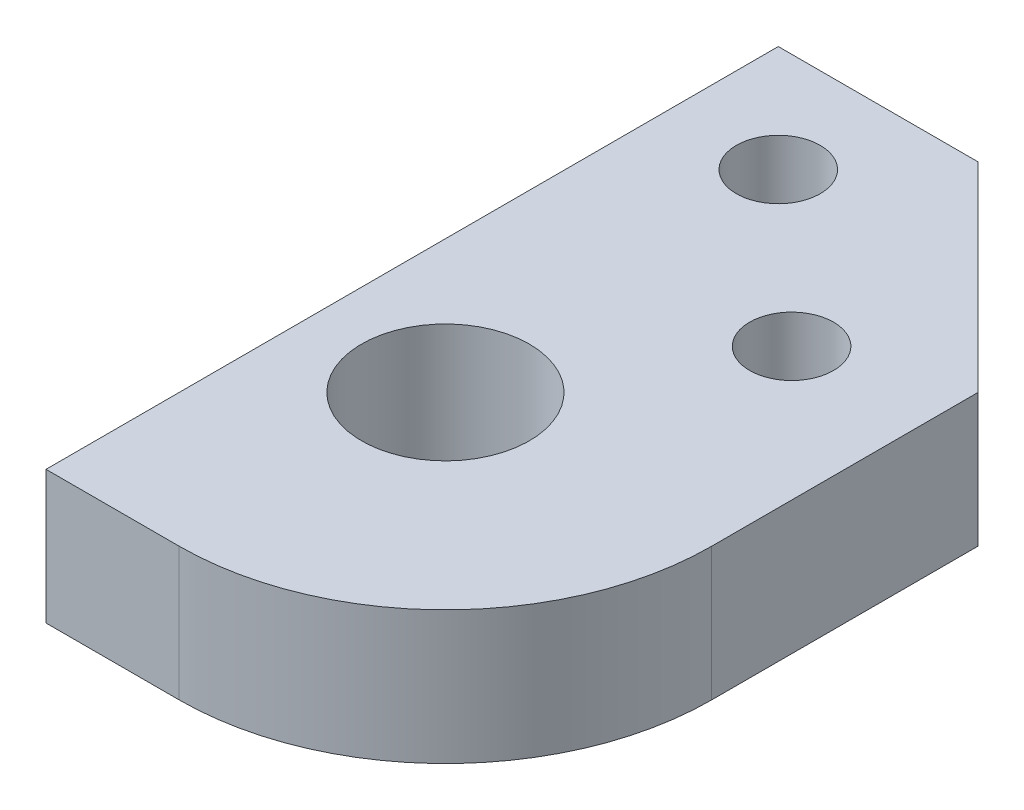
ISO-10303-21;
HEADER;
FILE_DESCRIPTION(('STEP AP214'),'2;1');
FILE_NAME('part.step','',(''),(''),'','','');
FILE_SCHEMA(('AUTOMOTIVE_DESIGN { 1 0 10303 214 1 1 1 1 }'));
ENDSEC;
DATA;
#1=APPLICATION_CONTEXT('core data for automotive mechanical design processes');
#2=APPLICATION_PROTOCOL_DEFINITION('international standard','automotive_design',2000,#1);
#3=PRODUCT_CONTEXT('',#1,'mechanical');
#4=PRODUCT('Part','Part','',(#3));
#5=PRODUCT_RELATED_PRODUCT_CATEGORY('part','',(#4));
#6=PRODUCT_DEFINITION_FORMATION('','',#4);
#7=PRODUCT_DEFINITION_CONTEXT('part definition',#1,'design');
#8=PRODUCT_DEFINITION('design','',#6,#7);
#9=PRODUCT_DEFINITION_SHAPE('','',#8);
#10=(LENGTH_UNIT() NAMED_UNIT(*) SI_UNIT(.MILLI.,.METRE.));
#11=(NAMED_UNIT(*) PLANE_ANGLE_UNIT() SI_UNIT($,.RADIAN.));
#12=(NAMED_UNIT(*) SI_UNIT($,.STERADIAN.) SOLID_ANGLE_UNIT());
#13=UNCERTAINTY_MEASURE_WITH_UNIT(LENGTH_MEASURE(1.E-05),#10,'distance_accuracy_value','');
#14=(GEOMETRIC_REPRESENTATION_CONTEXT(3) GLOBAL_UNCERTAINTY_ASSIGNED_CONTEXT((#13)) GLOBAL_UNIT_ASSIGNED_CONTEXT((#10,
#11,#12)) REPRESENTATION_CONTEXT('',''));
#15=CARTESIAN_POINT('',(0.,0.,0.));
#16=DIRECTION('',(0.,0.,1.));
#17=DIRECTION('',(1.,0.,0.));
#18=AXIS2_PLACEMENT_3D('',#15,#16,#17);
#19=CARTESIAN_POINT('',(12.7,6.35,114.3));
#20=DIRECTION('',(0.,-1.,0.));
#21=DIRECTION('',(0.,0.,1.));
#22=AXIS2_PLACEMENT_3D('',#19,#20,#21);
#23=CYLINDRICAL_SURFACE('',#22,12.7);
#24=CARTESIAN_POINT('',(12.7,0.,114.3));
#25=DIRECTION('',(0.,-1.,0.));
#26=DIRECTION('',(0.,0.,-1.));
#27=AXIS2_PLACEMENT_3D('',#24,#25,#26);
#28=CIRCLE('',#27,12.7);
#29=CARTESIAN_POINT('',(12.6999999999999,0.,127.));
#30=VERTEX_POINT('',#29);
#31=CARTESIAN_POINT('',(25.4,0.,114.3));
#32=VERTEX_POINT('',#31);
#33=EDGE_CURVE('E133',#30,#32,#28,.F.);
#34=ORIENTED_EDGE('',*,*,#33,.T.);
#35=DIRECTION('',(0.,-1.,0.));
#36=VECTOR('',#35,1.);
#37=CARTESIAN_POINT('',(25.4,6.35,114.3));
#38=LINE('',#37,#36);
#39=CARTESIAN_POINT('',(25.4,6.35,114.3));
#40=VERTEX_POINT('',#39);
#41=EDGE_CURVE('E129',#40,#32,#38,.T.);
#42=ORIENTED_EDGE('',*,*,#41,.F.);
#43=CARTESIAN_POINT('',(12.7,6.35,114.3));
#44=DIRECTION('',(0.,-1.,0.));
#45=DIRECTION('',(0.,0.,-1.));
#46=AXIS2_PLACEMENT_3D('',#43,#44,#45);
#47=CIRCLE('',#46,12.7);
#48=CARTESIAN_POINT('',(12.6999999999999,6.35,127.));
#49=VERTEX_POINT('',#48);
#50=EDGE_CURVE('E165',#49,#40,#47,.F.);
#51=ORIENTED_EDGE('',*,*,#50,.F.);
#52=DIRECTION('',(0.,-1.,0.));
#53=VECTOR('',#52,1.);
#54=CARTESIAN_POINT('',(12.6999999999999,6.35,127.));
#55=LINE('',#54,#53);
#56=EDGE_CURVE('E11',#49,#30,#55,.T.);
#57=ORIENTED_EDGE('',*,*,#56,.T.);
#58=EDGE_LOOP('',(#34,#42,#51,#57));
#59=FACE_BOUND('',#58,.T.);
#60=ADVANCED_FACE('F39',(#59),#23,.T.);
#61=CARTESIAN_POINT('',(0.,6.35,127.));
#62=DIRECTION('',(0.,0.,1.));
#63=DIRECTION('',(-1.,0.,0.));
#64=AXIS2_PLACEMENT_3D('',#61,#62,#63);
#65=PLANE('',#64);
#66=DIRECTION('',(1.,0.,0.));
#67=VECTOR('',#66,1.);
#68=CARTESIAN_POINT('',(0.,0.,127.));
#69=LINE('',#68,#67);
#70=CARTESIAN_POINT('',(6.3499999999998,0.,127.));
#71=VERTEX_POINT('',#70);
#72=EDGE_CURVE('E136',#71,#30,#69,.T.);
#73=ORIENTED_EDGE('',*,*,#72,.T.);
#74=ORIENTED_EDGE('',*,*,#56,.F.);
#75=DIRECTION('',(1.,0.,0.));
#76=VECTOR('',#75,1.);
#77=CARTESIAN_POINT('',(0.,6.35,127.));
#78=LINE('',#77,#76);
#79=CARTESIAN_POINT('',(6.3499999999998,6.35,127.));
#80=VERTEX_POINT('',#79);
#81=EDGE_CURVE('E88',#80,#49,#78,.T.);
#82=ORIENTED_EDGE('',*,*,#81,.F.);
#83=DIRECTION('',(0.,-1.,0.));
#84=VECTOR('',#83,1.);
#85=CARTESIAN_POINT('',(6.3499999999998,6.35,127.));
#86=LINE('',#85,#84);
#87=EDGE_CURVE('E48',#80,#71,#86,.T.);
#88=ORIENTED_EDGE('',*,*,#87,.T.);
#89=EDGE_LOOP('',(#73,#74,#82,#88));
#90=FACE_BOUND('',#89,.T.);
#91=ADVANCED_FACE('F158',(#90),#65,.T.);
#92=CARTESIAN_POINT('',(6.3500000000005,6.35,0.));
#93=DIRECTION('',(1.,0.,0.));
#94=DIRECTION('',(0.,0.,1.));
#95=AXIS2_PLACEMENT_3D('',#92,#93,#94);
#96=PLANE('',#95);
#97=DIRECTION('',(0.,0.,-1.));
#98=VECTOR('',#97,1.);
#99=CARTESIAN_POINT('',(6.3500000000005,0.,0.));
#100=LINE('',#99,#98);
#101=CARTESIAN_POINT('',(6.34999999999996,0.,92.0749999999997));
#102=VERTEX_POINT('',#101);
#103=EDGE_CURVE('E138',#71,#102,#100,.T.);
#104=ORIENTED_EDGE('',*,*,#103,.F.);
#105=ORIENTED_EDGE('',*,*,#87,.F.);
#106=DIRECTION('',(0.,0.,-1.));
#107=VECTOR('',#106,1.);
#108=CARTESIAN_POINT('',(6.3500000000005,6.35,0.));
#109=LINE('',#108,#107);
#110=CARTESIAN_POINT('',(6.34999999999996,6.35,92.0749999999997));
#111=VERTEX_POINT('',#110);
#112=EDGE_CURVE('E117',#80,#111,#109,.T.);
#113=ORIENTED_EDGE('',*,*,#112,.T.);
#114=DIRECTION('',(0.,-1.,0.));
#115=VECTOR('',#114,1.);
#116=CARTESIAN_POINT('',(6.34999999999996,6.35,92.0749999999997));
#117=LINE('',#116,#115);
#118=EDGE_CURVE('E111',#111,#102,#117,.T.);
#119=ORIENTED_EDGE('',*,*,#118,.T.);
#120=EDGE_LOOP('',(#104,#105,#113,#119));
#121=FACE_BOUND('',#120,.T.);
#122=ADVANCED_FACE('F189',(#121),#96,.F.);
#123=CARTESIAN_POINT('',(-1.34151948808872E-13,6.35,92.0749999999997));
#124=DIRECTION('',(0.,0.,1.));
#125=DIRECTION('',(-1.,0.,0.));
#126=AXIS2_PLACEMENT_3D('',#123,#124,#125);
#127=PLANE('',#126);
#128=DIRECTION('',(1.,0.,0.));
#129=VECTOR('',#128,1.);
#130=CARTESIAN_POINT('',(-1.34151948808872E-13,0.,92.0749999999997));
#131=LINE('',#130,#129);
#132=CARTESIAN_POINT('',(15.875,0.,92.0749999999998));
#133=VERTEX_POINT('',#132);
#134=EDGE_CURVE('E141',#102,#133,#131,.T.);
#135=ORIENTED_EDGE('',*,*,#134,.F.);
#136=ORIENTED_EDGE('',*,*,#118,.F.);
#137=DIRECTION('',(1.,0.,0.));
#138=VECTOR('',#137,1.);
#139=CARTESIAN_POINT('',(-1.34151948808872E-13,6.35,92.0749999999997));
#140=LINE('',#139,#138);
#141=CARTESIAN_POINT('',(15.875,6.35,92.0749999999998));
#142=VERTEX_POINT('',#141);
#143=EDGE_CURVE('E101',#111,#142,#140,.T.);
#144=ORIENTED_EDGE('',*,*,#143,.T.);
#145=DIRECTION('',(0.,-1.,0.));
#146=VECTOR('',#145,1.);
#147=CARTESIAN_POINT('',(15.875,6.35,92.0749999999998));
#148=LINE('',#147,#146);
#149=EDGE_CURVE('E106',#142,#133,#148,.T.);
#150=ORIENTED_EDGE('',*,*,#149,.T.);
#151=EDGE_LOOP('',(#135,#136,#144,#150));
#152=FACE_BOUND('',#151,.T.);
#153=ADVANCED_FACE('F114',(#152),#127,.F.);
#154=CARTESIAN_POINT('',(-38.0999999999997,6.35,38.0999999999987));
#155=DIRECTION('',(0.707106781186556,0.,-0.707106781186539));
#156=DIRECTION('',(0.707106781186539,0.,0.707106781186556));
#157=AXIS2_PLACEMENT_3D('',#154,#155,#156);
#158=PLANE('',#157);
#159=DIRECTION('',(-0.707106781186539,0.,-0.707106781186556));
#160=VECTOR('',#159,1.);
#161=CARTESIAN_POINT('',(-38.0999999999997,0.,38.0999999999987));
#162=LINE('',#161,#160);
#163=CARTESIAN_POINT('',(25.4,0.,101.6));
#164=VERTEX_POINT('',#163);
#165=EDGE_CURVE('E108',#164,#133,#162,.T.);
#166=ORIENTED_EDGE('',*,*,#165,.T.);
#167=ORIENTED_EDGE('',*,*,#149,.F.);
#168=DIRECTION('',(-0.707106781186539,0.,-0.707106781186556));
#169=VECTOR('',#168,1.);
#170=CARTESIAN_POINT('',(-38.0999999999997,6.35,38.0999999999987));
#171=LINE('',#170,#169);
#172=CARTESIAN_POINT('',(25.4,6.35,101.6));
#173=VERTEX_POINT('',#172);
#174=EDGE_CURVE('E96',#173,#142,#171,.T.);
#175=ORIENTED_EDGE('',*,*,#174,.F.);
#176=DIRECTION('',(0.,-1.,0.));
#177=VECTOR('',#176,1.);
#178=CARTESIAN_POINT('',(25.4,6.35,101.6));
#179=LINE('',#178,#177);
#180=EDGE_CURVE('E112',#173,#164,#179,.T.);
#181=ORIENTED_EDGE('',*,*,#180,.T.);
#182=EDGE_LOOP('',(#166,#167,#175,#181));
#183=FACE_BOUND('',#182,.T.);
#184=ADVANCED_FACE('F107',(#183),#158,.T.);
#185=CARTESIAN_POINT('',(19.0499999999999,6.35,104.14));
#186=DIRECTION('',(0.,-1.,0.));
#187=DIRECTION('',(0.,0.,1.));
#188=AXIS2_PLACEMENT_3D('',#185,#186,#187);
#189=CYLINDRICAL_SURFACE('',#188,2.);
#190=CARTESIAN_POINT('',(19.0499999999999,6.35,104.14));
#191=DIRECTION('',(0.,-1.,0.));
#192=DIRECTION('',(0.,0.,-1.));
#193=AXIS2_PLACEMENT_3D('',#190,#191,#192);
#194=CIRCLE('',#193,2.);
#195=CARTESIAN_POINT('',(19.0499999999999,6.35,102.14));
#196=VERTEX_POINT('',#195);
#197=EDGE_CURVE('E123',#196,#196,#194,.T.);
#198=ORIENTED_EDGE('',*,*,#197,.F.);
#199=EDGE_LOOP('',(#198));
#200=FACE_BOUND('',#199,.T.);
#201=CARTESIAN_POINT('',(19.0499999999999,0.,104.14));
#202=DIRECTION('',(0.,-1.,0.));
#203=DIRECTION('',(0.,0.,-1.));
#204=AXIS2_PLACEMENT_3D('',#201,#202,#203);
#205=CIRCLE('',#204,2.);
#206=CARTESIAN_POINT('',(19.0499999999999,0.,102.14));
#207=VERTEX_POINT('',#206);
#208=EDGE_CURVE('E145',#207,#207,#205,.T.);
#209=ORIENTED_EDGE('',*,*,#208,.T.);
#210=EDGE_LOOP('',(#209));
#211=FACE_BOUND('',#210,.T.);
#212=ADVANCED_FACE('F198',(#200,#211),#189,.F.);
#213=CARTESIAN_POINT('',(25.4,6.35,0.));
#214=DIRECTION('',(-1.,0.,0.));
#215=DIRECTION('',(0.,0.,-1.));
#216=AXIS2_PLACEMENT_3D('',#213,#214,#215);
#217=PLANE('',#216);
#218=DIRECTION('',(0.,0.,1.));
#219=VECTOR('',#218,1.);
#220=CARTESIAN_POINT('',(25.4,0.,0.));
#221=LINE('',#220,#219);
#222=EDGE_CURVE('E76',#164,#32,#221,.T.);
#223=ORIENTED_EDGE('',*,*,#222,.F.);
#224=ORIENTED_EDGE('',*,*,#180,.F.);
#225=DIRECTION('',(0.,0.,1.));
#226=VECTOR('',#225,1.);
#227=CARTESIAN_POINT('',(25.4,6.35,0.));
#228=LINE('',#227,#226);
#229=EDGE_CURVE('E56',#173,#40,#228,.T.);
#230=ORIENTED_EDGE('',*,*,#229,.T.);
#231=ORIENTED_EDGE('',*,*,#41,.T.);
#232=EDGE_LOOP('',(#223,#224,#230,#231));
#233=FACE_BOUND('',#232,.T.);
#234=ADVANCED_FACE('F175',(#233),#217,.F.);
#235=CARTESIAN_POINT('',(12.7,6.35,114.3));
#236=DIRECTION('',(0.,-1.,0.));
#237=DIRECTION('',(0.,0.,1.));
#238=AXIS2_PLACEMENT_3D('',#235,#236,#237);
#239=CYLINDRICAL_SURFACE('',#238,4.0005);
#240=CARTESIAN_POINT('',(12.7,6.35,114.3));
#241=DIRECTION('',(0.,-1.,0.));
#242=DIRECTION('',(0.,0.,-1.));
#243=AXIS2_PLACEMENT_3D('',#240,#241,#242);
#244=CIRCLE('',#243,4.0005);
#245=CARTESIAN_POINT('',(12.7,6.35,110.2995));
#246=VERTEX_POINT('',#245);
#247=EDGE_CURVE('E151',#246,#246,#244,.T.);
#248=ORIENTED_EDGE('',*,*,#247,.F.);
#249=EDGE_LOOP('',(#248));
#250=FACE_BOUND('',#249,.T.);
#251=CARTESIAN_POINT('',(12.7,0.,114.3));
#252=DIRECTION('',(0.,-1.,0.));
#253=DIRECTION('',(0.,0.,-1.));
#254=AXIS2_PLACEMENT_3D('',#251,#252,#253);
#255=CIRCLE('',#254,4.0005);
#256=CARTESIAN_POINT('',(12.7,0.,110.2995));
#257=VERTEX_POINT('',#256);
#258=EDGE_CURVE('E130',#257,#257,#255,.T.);
#259=ORIENTED_EDGE('',*,*,#258,.T.);
#260=EDGE_LOOP('',(#259));
#261=FACE_BOUND('',#260,.T.);
#262=ADVANCED_FACE('F41',(#250,#261),#239,.F.);
#263=CARTESIAN_POINT('',(11.4299999999998,6.35,97.1549999999999));
#264=DIRECTION('',(0.,-1.,0.));
#265=DIRECTION('',(0.,0.,1.));
#266=AXIS2_PLACEMENT_3D('',#263,#264,#265);
#267=CYLINDRICAL_SURFACE('',#266,2.);
#268=CARTESIAN_POINT('',(11.4299999999998,6.35,97.1549999999999));
#269=DIRECTION('',(0.,-1.,0.));
#270=DIRECTION('',(0.,0.,-1.));
#271=AXIS2_PLACEMENT_3D('',#268,#269,#270);
#272=CIRCLE('',#271,2.);
#273=CARTESIAN_POINT('',(11.4299999999998,6.35,95.1549999999999));
#274=VERTEX_POINT('',#273);
#275=EDGE_CURVE('E126',#274,#274,#272,.T.);
#276=ORIENTED_EDGE('',*,*,#275,.F.);
#277=EDGE_LOOP('',(#276));
#278=FACE_BOUND('',#277,.T.);
#279=CARTESIAN_POINT('',(11.4299999999998,0.,97.1549999999999));
#280=DIRECTION('',(0.,-1.,0.));
#281=DIRECTION('',(0.,0.,-1.));
#282=AXIS2_PLACEMENT_3D('',#279,#280,#281);
#283=CIRCLE('',#282,2.);
#284=CARTESIAN_POINT('',(11.4299999999998,0.,95.1549999999999));
#285=VERTEX_POINT('',#284);
#286=EDGE_CURVE('E148',#285,#285,#283,.T.);
#287=ORIENTED_EDGE('',*,*,#286,.T.);
#288=EDGE_LOOP('',(#287));
#289=FACE_BOUND('',#288,.T.);
#290=ADVANCED_FACE('F174',(#278,#289),#267,.F.);
#291=CARTESIAN_POINT('',(0.,6.35,0.));
#292=DIRECTION('',(0.,1.,0.));
#293=DIRECTION('',(0.,0.,-1.));
#294=AXIS2_PLACEMENT_3D('',#291,#292,#293);
#295=PLANE('',#294);
#296=ORIENTED_EDGE('',*,*,#247,.T.);
#297=EDGE_LOOP('',(#296));
#298=FACE_BOUND('',#297,.T.);
#299=ORIENTED_EDGE('',*,*,#50,.T.);
#300=ORIENTED_EDGE('',*,*,#229,.F.);
#301=ORIENTED_EDGE('',*,*,#174,.T.);
#302=ORIENTED_EDGE('',*,*,#143,.F.);
#303=ORIENTED_EDGE('',*,*,#112,.F.);
#304=ORIENTED_EDGE('',*,*,#81,.T.);
#305=EDGE_LOOP('',(#299,#300,#301,#302,#303,#304));
#306=FACE_BOUND('',#305,.T.);
#307=ORIENTED_EDGE('',*,*,#197,.T.);
#308=EDGE_LOOP('',(#307));
#309=FACE_BOUND('',#308,.T.);
#310=ORIENTED_EDGE('',*,*,#275,.T.);
#311=EDGE_LOOP('',(#310));
#312=FACE_BOUND('',#311,.T.);
#313=ADVANCED_FACE('F98',(#298,#306,#309,#312),#295,.T.);
#314=CARTESIAN_POINT('',(0.,0.,0.));
#315=DIRECTION('',(0.,1.,0.));
#316=DIRECTION('',(0.,0.,-1.));
#317=AXIS2_PLACEMENT_3D('',#314,#315,#316);
#318=PLANE('',#317);
#319=ORIENTED_EDGE('',*,*,#258,.F.);
#320=EDGE_LOOP('',(#319));
#321=FACE_BOUND('',#320,.T.);
#322=ORIENTED_EDGE('',*,*,#33,.F.);
#323=ORIENTED_EDGE('',*,*,#72,.F.);
#324=ORIENTED_EDGE('',*,*,#103,.T.);
#325=ORIENTED_EDGE('',*,*,#134,.T.);
#326=ORIENTED_EDGE('',*,*,#165,.F.);
#327=ORIENTED_EDGE('',*,*,#222,.T.);
#328=EDGE_LOOP('',(#322,#323,#324,#325,#326,#327));
#329=FACE_BOUND('',#328,.T.);
#330=ORIENTED_EDGE('',*,*,#208,.F.);
#331=EDGE_LOOP('',(#330));
#332=FACE_BOUND('',#331,.T.);
#333=ORIENTED_EDGE('',*,*,#286,.F.);
#334=EDGE_LOOP('',(#333));
#335=FACE_BOUND('',#334,.T.);
#336=ADVANCED_FACE('F160',(#321,#329,#332,#335),#318,.F.);
#337=CLOSED_SHELL('',(#60,#91,#122,#153,#184,#212,#234,#262,#290,#313,#336));
#338=MANIFOLD_SOLID_BREP('B2',#337);
#339=ADVANCED_BREP_SHAPE_REPRESENTATION('',(#18,#338),#14);
#340=SHAPE_DEFINITION_REPRESENTATION(#9,#339);
ENDSEC;
END-ISO-10303-21;
